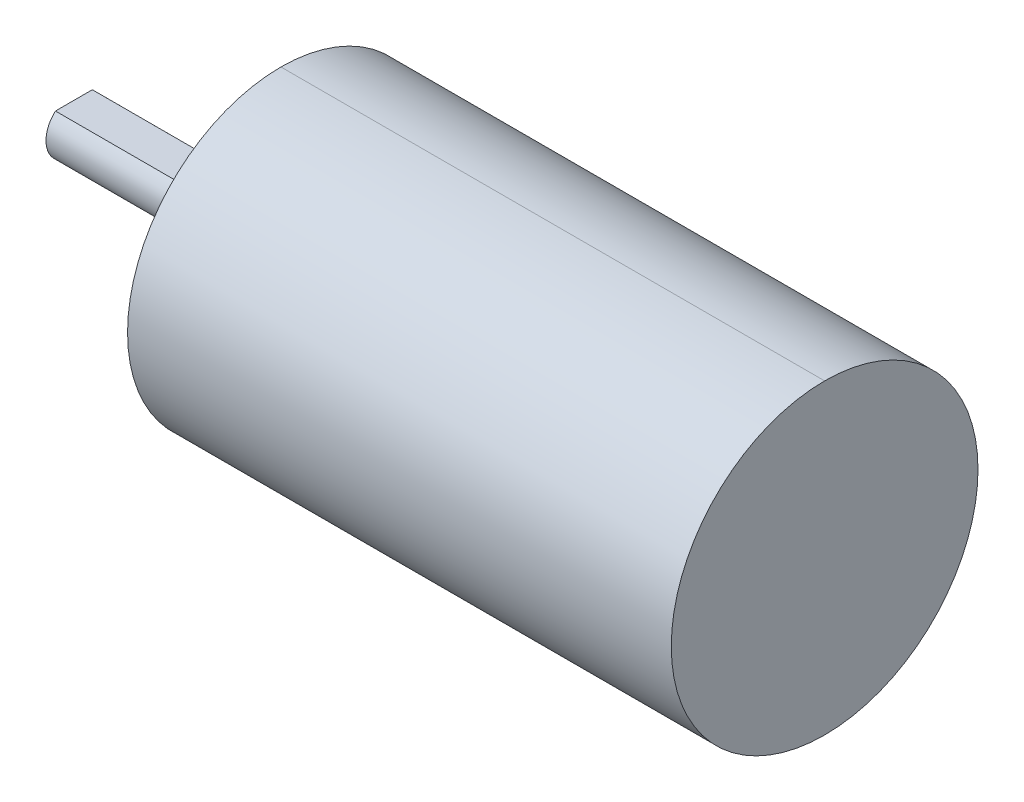
ISO-10303-21;
HEADER;
FILE_DESCRIPTION(('STEP AP214'),'2;1');
FILE_NAME('part.step','',(''),(''),'','','');
FILE_SCHEMA(('AUTOMOTIVE_DESIGN { 1 0 10303 214 1 1 1 1 }'));
ENDSEC;
DATA;
#1=APPLICATION_CONTEXT('core data for automotive mechanical design processes');
#2=APPLICATION_PROTOCOL_DEFINITION('international standard','automotive_design',2000,#1);
#3=PRODUCT_CONTEXT('',#1,'mechanical');
#4=PRODUCT('Part','Part','',(#3));
#5=PRODUCT_RELATED_PRODUCT_CATEGORY('part','',(#4));
#6=PRODUCT_DEFINITION_FORMATION('','',#4);
#7=PRODUCT_DEFINITION_CONTEXT('part definition',#1,'design');
#8=PRODUCT_DEFINITION('design','',#6,#7);
#9=PRODUCT_DEFINITION_SHAPE('','',#8);
#10=(LENGTH_UNIT() NAMED_UNIT(*) SI_UNIT(.MILLI.,.METRE.));
#11=(NAMED_UNIT(*) PLANE_ANGLE_UNIT() SI_UNIT($,.RADIAN.));
#12=(NAMED_UNIT(*) SI_UNIT($,.STERADIAN.) SOLID_ANGLE_UNIT());
#13=UNCERTAINTY_MEASURE_WITH_UNIT(LENGTH_MEASURE(1.E-05),#10,'distance_accuracy_value','');
#14=(GEOMETRIC_REPRESENTATION_CONTEXT(3) GLOBAL_UNCERTAINTY_ASSIGNED_CONTEXT((#13)) GLOBAL_UNIT_ASSIGNED_CONTEXT((#10,
#11,#12)) REPRESENTATION_CONTEXT('',''));
#15=CARTESIAN_POINT('',(0.,0.,0.));
#16=DIRECTION('',(0.,0.,1.));
#17=DIRECTION('',(1.,0.,0.));
#18=AXIS2_PLACEMENT_3D('',#15,#16,#17);
#19=CARTESIAN_POINT('',(21.15794106725,-3.5,6.062177826491));
#20=DIRECTION('',(-1.,0.,0.));
#21=DIRECTION('',(0.,-0.500000000000017,0.866025403784429));
#22=AXIS2_PLACEMENT_3D('',#19,#20,#21);
#23=CONICAL_SURFACE('',#22,0.5125,1.02974425867646);
#24=CARTESIAN_POINT('',(20.85,-3.5,6.062177826491));
#25=DIRECTION('',(-1.,0.,0.));
#26=DIRECTION('',(0.,-0.500000000000017,0.866025403784429));
#27=AXIS2_PLACEMENT_3D('',#24,#25,#26);
#28=CIRCLE('',#27,1.025);
#29=CARTESIAN_POINT('',(20.85,-4.0125,6.94985386537));
#30=VERTEX_POINT('',#29);
#31=CARTESIAN_POINT('',(20.85,-2.9875,5.174501787612));
#32=VERTEX_POINT('',#31);
#33=EDGE_CURVE('E247',#30,#32,#28,.T.);
#34=ORIENTED_EDGE('',*,*,#33,.T.);
#35=DIRECTION('',(-0.515038074910065,0.42858365035107,-0.742328657701349));
#36=VECTOR('',#35,1.);
#37=CARTESIAN_POINT('',(21.4658821345,-3.5,6.062177826491));
#38=LINE('',#37,#36);
#39=CARTESIAN_POINT('',(21.4658821345,-3.5,6.062177826491));
#40=VERTEX_POINT('',#39);
#41=EDGE_CURVE('E29',#40,#32,#38,.T.);
#42=ORIENTED_EDGE('',*,*,#41,.F.);
#43=DIRECTION('',(-0.515038074910065,-0.42858365035107,0.742328657701349));
#44=VECTOR('',#43,1.);
#45=CARTESIAN_POINT('',(21.4658821345,-3.5,6.062177826491));
#46=LINE('',#45,#44);
#47=EDGE_CURVE('E11',#40,#30,#46,.T.);
#48=ORIENTED_EDGE('',*,*,#47,.T.);
#49=EDGE_LOOP('',(#34,#42,#48));
#50=FACE_BOUND('',#49,.T.);
#51=ADVANCED_FACE('F17',(#50),#23,.F.);
#52=CARTESIAN_POINT('',(21.15794106725,-3.5,6.062177826491));
#53=DIRECTION('',(-1.,0.,0.));
#54=DIRECTION('',(0.,-0.500000000000017,0.866025403784429));
#55=AXIS2_PLACEMENT_3D('',#52,#53,#54);
#56=CONICAL_SURFACE('',#55,0.5125,1.02974425867646);
#57=ORIENTED_EDGE('',*,*,#41,.T.);
#58=CARTESIAN_POINT('',(20.85,-3.5,6.062177826491));
#59=DIRECTION('',(1.,0.,0.));
#60=DIRECTION('',(0.,-0.500000000000017,0.866025403784429));
#61=AXIS2_PLACEMENT_3D('',#58,#59,#60);
#62=CIRCLE('',#61,1.025);
#63=EDGE_CURVE('E218',#30,#32,#62,.T.);
#64=ORIENTED_EDGE('',*,*,#63,.F.);
#65=ORIENTED_EDGE('',*,*,#47,.F.);
#66=EDGE_LOOP('',(#57,#64,#65));
#67=FACE_BOUND('',#66,.T.);
#68=ADVANCED_FACE('F397',(#67),#56,.F.);
#69=CARTESIAN_POINT('',(21.79667624123,-3.5,6.062177826491));
#70=DIRECTION('',(-1.,0.,0.));
#71=DIRECTION('',(0.,-0.500000000000017,0.866025403784429));
#72=AXIS2_PLACEMENT_3D('',#69,#70,#71);
#73=CYLINDRICAL_SURFACE('',#72,1.025);
#74=DIRECTION('',(-1.,0.,0.));
#75=VECTOR('',#74,1.);
#76=CARTESIAN_POINT('',(20.85,-4.0125,6.94985386537));
#77=LINE('',#76,#75);
#78=CARTESIAN_POINT('',(14.85,-4.0125,6.94985386537));
#79=VERTEX_POINT('',#78);
#80=EDGE_CURVE('E244',#30,#79,#77,.T.);
#81=ORIENTED_EDGE('',*,*,#80,.F.);
#82=ORIENTED_EDGE('',*,*,#63,.T.);
#83=DIRECTION('',(-1.,0.,0.));
#84=VECTOR('',#83,1.);
#85=CARTESIAN_POINT('',(20.85,-2.9875,5.174501787612));
#86=LINE('',#85,#84);
#87=CARTESIAN_POINT('',(14.85,-2.9875,5.174501787612));
#88=VERTEX_POINT('',#87);
#89=EDGE_CURVE('E186',#32,#88,#86,.T.);
#90=ORIENTED_EDGE('',*,*,#89,.T.);
#91=CARTESIAN_POINT('',(14.85,-3.5,6.062177826491));
#92=DIRECTION('',(-1.,0.,0.));
#93=DIRECTION('',(0.,0.500000000000017,-0.866025403784429));
#94=AXIS2_PLACEMENT_3D('',#91,#92,#93);
#95=CIRCLE('',#94,1.025);
#96=EDGE_CURVE('E265',#88,#79,#95,.T.);
#97=ORIENTED_EDGE('',*,*,#96,.T.);
#98=EDGE_LOOP('',(#81,#82,#90,#97));
#99=FACE_BOUND('',#98,.T.);
#100=ADVANCED_FACE('F476',(#99),#73,.F.);
#101=CARTESIAN_POINT('',(21.79667624123,-3.5,6.062177826491));
#102=DIRECTION('',(-1.,0.,0.));
#103=DIRECTION('',(0.,-0.500000000000017,0.866025403784429));
#104=AXIS2_PLACEMENT_3D('',#101,#102,#103);
#105=CYLINDRICAL_SURFACE('',#104,1.025);
#106=ORIENTED_EDGE('',*,*,#89,.F.);
#107=ORIENTED_EDGE('',*,*,#33,.F.);
#108=ORIENTED_EDGE('',*,*,#80,.T.);
#109=CARTESIAN_POINT('',(14.85,-3.5,6.062177826491));
#110=DIRECTION('',(-1.,0.,0.));
#111=DIRECTION('',(0.,-0.500000000000017,0.866025403784429));
#112=AXIS2_PLACEMENT_3D('',#109,#110,#111);
#113=CIRCLE('',#112,1.025);
#114=EDGE_CURVE('E262',#79,#88,#113,.T.);
#115=ORIENTED_EDGE('',*,*,#114,.T.);
#116=EDGE_LOOP('',(#106,#107,#108,#115));
#117=FACE_BOUND('',#116,.T.);
#118=ADVANCED_FACE('F382',(#117),#105,.F.);
#119=CARTESIAN_POINT('',(21.15794106725,-3.5,-6.062177826491));
#120=DIRECTION('',(-1.,0.,0.));
#121=DIRECTION('',(0.,-0.500000000000017,-0.866025403784429));
#122=AXIS2_PLACEMENT_3D('',#119,#120,#121);
#123=CONICAL_SURFACE('',#122,0.5125,1.02974425867646);
#124=CARTESIAN_POINT('',(20.85,-3.5,-6.062177826491));
#125=DIRECTION('',(-1.,0.,0.));
#126=DIRECTION('',(0.,-0.500000000000017,-0.866025403784429));
#127=AXIS2_PLACEMENT_3D('',#124,#125,#126);
#128=CIRCLE('',#127,1.025);
#129=CARTESIAN_POINT('',(20.85,-4.0125,-6.94985386537));
#130=VERTEX_POINT('',#129);
#131=CARTESIAN_POINT('',(20.85,-2.9875,-5.174501787612));
#132=VERTEX_POINT('',#131);
#133=EDGE_CURVE('E190',#130,#132,#128,.T.);
#134=ORIENTED_EDGE('',*,*,#133,.T.);
#135=DIRECTION('',(-0.515038074910065,0.42858365035107,0.742328657701349));
#136=VECTOR('',#135,1.);
#137=CARTESIAN_POINT('',(21.4658821345,-3.5,-6.062177826491));
#138=LINE('',#137,#136);
#139=CARTESIAN_POINT('',(21.4658821345,-3.5,-6.062177826491));
#140=VERTEX_POINT('',#139);
#141=EDGE_CURVE('E179',#140,#132,#138,.T.);
#142=ORIENTED_EDGE('',*,*,#141,.F.);
#143=DIRECTION('',(-0.515038074910065,-0.42858365035107,-0.742328657701349));
#144=VECTOR('',#143,1.);
#145=CARTESIAN_POINT('',(21.4658821345,-3.5,-6.062177826491));
#146=LINE('',#145,#144);
#147=EDGE_CURVE('E176',#140,#130,#146,.T.);
#148=ORIENTED_EDGE('',*,*,#147,.T.);
#149=EDGE_LOOP('',(#134,#142,#148));
#150=FACE_BOUND('',#149,.T.);
#151=ADVANCED_FACE('F188',(#150),#123,.F.);
#152=CARTESIAN_POINT('',(21.15794106725,-3.5,-6.062177826491));
#153=DIRECTION('',(-1.,0.,0.));
#154=DIRECTION('',(0.,-0.500000000000017,-0.866025403784429));
#155=AXIS2_PLACEMENT_3D('',#152,#153,#154);
#156=CONICAL_SURFACE('',#155,0.5125,1.02974425867646);
#157=ORIENTED_EDGE('',*,*,#141,.T.);
#158=CARTESIAN_POINT('',(20.85,-3.5,-6.062177826491));
#159=DIRECTION('',(1.,0.,0.));
#160=DIRECTION('',(0.,-0.500000000000017,-0.866025403784429));
#161=AXIS2_PLACEMENT_3D('',#158,#159,#160);
#162=CIRCLE('',#161,1.025);
#163=EDGE_CURVE('E181',#130,#132,#162,.T.);
#164=ORIENTED_EDGE('',*,*,#163,.F.);
#165=ORIENTED_EDGE('',*,*,#147,.F.);
#166=EDGE_LOOP('',(#157,#164,#165));
#167=FACE_BOUND('',#166,.T.);
#168=ADVANCED_FACE('F178',(#167),#156,.F.);
#169=CARTESIAN_POINT('',(21.79667624123,-3.5,-6.062177826491));
#170=DIRECTION('',(-1.,0.,0.));
#171=DIRECTION('',(0.,-0.500000000000017,-0.866025403784429));
#172=AXIS2_PLACEMENT_3D('',#169,#170,#171);
#173=CYLINDRICAL_SURFACE('',#172,1.025);
#174=DIRECTION('',(-1.,0.,0.));
#175=VECTOR('',#174,1.);
#176=CARTESIAN_POINT('',(20.85,-4.0125,-6.94985386537));
#177=LINE('',#176,#175);
#178=CARTESIAN_POINT('',(14.85,-4.0125,-6.94985386537));
#179=VERTEX_POINT('',#178);
#180=EDGE_CURVE('E199',#130,#179,#177,.T.);
#181=ORIENTED_EDGE('',*,*,#180,.F.);
#182=ORIENTED_EDGE('',*,*,#163,.T.);
#183=DIRECTION('',(-1.,0.,0.));
#184=VECTOR('',#183,1.);
#185=CARTESIAN_POINT('',(20.85,-2.9875,-5.174501787612));
#186=LINE('',#185,#184);
#187=CARTESIAN_POINT('',(14.85,-2.9875,-5.174501787612));
#188=VERTEX_POINT('',#187);
#189=EDGE_CURVE('E225',#132,#188,#186,.T.);
#190=ORIENTED_EDGE('',*,*,#189,.T.);
#191=CARTESIAN_POINT('',(14.85,-3.5,-6.062177826491));
#192=DIRECTION('',(-1.,0.,0.));
#193=DIRECTION('',(0.,0.500000000000017,0.866025403784429));
#194=AXIS2_PLACEMENT_3D('',#191,#192,#193);
#195=CIRCLE('',#194,1.025);
#196=EDGE_CURVE('E309',#188,#179,#195,.T.);
#197=ORIENTED_EDGE('',*,*,#196,.T.);
#198=EDGE_LOOP('',(#181,#182,#190,#197));
#199=FACE_BOUND('',#198,.T.);
#200=ADVANCED_FACE('F406',(#199),#173,.F.);
#201=CARTESIAN_POINT('',(21.79667624123,-3.5,-6.062177826491));
#202=DIRECTION('',(-1.,0.,0.));
#203=DIRECTION('',(0.,-0.500000000000017,-0.866025403784429));
#204=AXIS2_PLACEMENT_3D('',#201,#202,#203);
#205=CYLINDRICAL_SURFACE('',#204,1.025);
#206=ORIENTED_EDGE('',*,*,#189,.F.);
#207=ORIENTED_EDGE('',*,*,#133,.F.);
#208=ORIENTED_EDGE('',*,*,#180,.T.);
#209=CARTESIAN_POINT('',(14.85,-3.5,-6.062177826491));
#210=DIRECTION('',(-1.,0.,0.));
#211=DIRECTION('',(0.,-0.500000000000017,-0.866025403784429));
#212=AXIS2_PLACEMENT_3D('',#209,#210,#211);
#213=CIRCLE('',#212,1.025);
#214=EDGE_CURVE('E313',#179,#188,#213,.T.);
#215=ORIENTED_EDGE('',*,*,#214,.T.);
#216=EDGE_LOOP('',(#206,#207,#208,#215));
#217=FACE_BOUND('',#216,.T.);
#218=ADVANCED_FACE('F408',(#217),#205,.F.);
#219=CARTESIAN_POINT('',(21.15794106725,7.,0.));
#220=DIRECTION('',(-1.,0.,0.));
#221=DIRECTION('',(0.,1.,0.));
#222=AXIS2_PLACEMENT_3D('',#219,#220,#221);
#223=CONICAL_SURFACE('',#222,0.5125,1.02974425867646);
#224=CARTESIAN_POINT('',(20.85,7.,0.));
#225=DIRECTION('',(-1.,0.,0.));
#226=DIRECTION('',(0.,1.,0.));
#227=AXIS2_PLACEMENT_3D('',#224,#225,#226);
#228=CIRCLE('',#227,1.025);
#229=CARTESIAN_POINT('',(20.85,8.025,0.));
#230=VERTEX_POINT('',#229);
#231=CARTESIAN_POINT('',(20.85,5.975,0.));
#232=VERTEX_POINT('',#231);
#233=EDGE_CURVE('E274',#230,#232,#228,.T.);
#234=ORIENTED_EDGE('',*,*,#233,.T.);
#235=DIRECTION('',(-0.515038074910093,-0.857167300702089,0.));
#236=VECTOR('',#235,1.);
#237=CARTESIAN_POINT('',(21.4658821345,7.,0.));
#238=LINE('',#237,#236);
#239=CARTESIAN_POINT('',(21.4658821345,7.,0.));
#240=VERTEX_POINT('',#239);
#241=EDGE_CURVE('E306',#240,#232,#238,.T.);
#242=ORIENTED_EDGE('',*,*,#241,.F.);
#243=DIRECTION('',(-0.515038074910093,0.857167300702089,0.));
#244=VECTOR('',#243,1.);
#245=CARTESIAN_POINT('',(21.4658821345,7.,0.));
#246=LINE('',#245,#244);
#247=EDGE_CURVE('E228',#240,#230,#246,.T.);
#248=ORIENTED_EDGE('',*,*,#247,.T.);
#249=EDGE_LOOP('',(#234,#242,#248));
#250=FACE_BOUND('',#249,.T.);
#251=ADVANCED_FACE('F404',(#250),#223,.F.);
#252=CARTESIAN_POINT('',(21.15794106725,7.,0.));
#253=DIRECTION('',(-1.,0.,0.));
#254=DIRECTION('',(0.,1.,0.));
#255=AXIS2_PLACEMENT_3D('',#252,#253,#254);
#256=CONICAL_SURFACE('',#255,0.5125,1.02974425867646);
#257=ORIENTED_EDGE('',*,*,#241,.T.);
#258=CARTESIAN_POINT('',(20.85,7.,0.));
#259=DIRECTION('',(1.,0.,0.));
#260=DIRECTION('',(0.,1.,0.));
#261=AXIS2_PLACEMENT_3D('',#258,#259,#260);
#262=CIRCLE('',#261,1.025);
#263=EDGE_CURVE('E302',#230,#232,#262,.T.);
#264=ORIENTED_EDGE('',*,*,#263,.F.);
#265=ORIENTED_EDGE('',*,*,#247,.F.);
#266=EDGE_LOOP('',(#257,#264,#265));
#267=FACE_BOUND('',#266,.T.);
#268=ADVANCED_FACE('F401',(#267),#256,.F.);
#269=CARTESIAN_POINT('',(21.79667624123,7.,0.));
#270=DIRECTION('',(-1.,0.,0.));
#271=DIRECTION('',(0.,1.,0.));
#272=AXIS2_PLACEMENT_3D('',#269,#270,#271);
#273=CYLINDRICAL_SURFACE('',#272,1.025);
#274=DIRECTION('',(-1.,0.,0.));
#275=VECTOR('',#274,1.);
#276=CARTESIAN_POINT('',(20.85,8.025,0.));
#277=LINE('',#276,#275);
#278=CARTESIAN_POINT('',(14.85,8.025,0.));
#279=VERTEX_POINT('',#278);
#280=EDGE_CURVE('E278',#230,#279,#277,.T.);
#281=ORIENTED_EDGE('',*,*,#280,.F.);
#282=ORIENTED_EDGE('',*,*,#263,.T.);
#283=DIRECTION('',(-1.,0.,0.));
#284=VECTOR('',#283,1.);
#285=CARTESIAN_POINT('',(20.85,5.975,0.));
#286=LINE('',#285,#284);
#287=CARTESIAN_POINT('',(14.85,5.975,0.));
#288=VERTEX_POINT('',#287);
#289=EDGE_CURVE('E279',#232,#288,#286,.T.);
#290=ORIENTED_EDGE('',*,*,#289,.T.);
#291=CARTESIAN_POINT('',(14.85,7.,0.));
#292=DIRECTION('',(-1.,0.,0.));
#293=DIRECTION('',(0.,-1.,0.));
#294=AXIS2_PLACEMENT_3D('',#291,#292,#293);
#295=CIRCLE('',#294,1.025);
#296=EDGE_CURVE('E289',#288,#279,#295,.T.);
#297=ORIENTED_EDGE('',*,*,#296,.T.);
#298=EDGE_LOOP('',(#281,#282,#290,#297));
#299=FACE_BOUND('',#298,.T.);
#300=ADVANCED_FACE('F403',(#299),#273,.F.);
#301=CARTESIAN_POINT('',(21.79667624123,7.,0.));
#302=DIRECTION('',(-1.,0.,0.));
#303=DIRECTION('',(0.,1.,0.));
#304=AXIS2_PLACEMENT_3D('',#301,#302,#303);
#305=CYLINDRICAL_SURFACE('',#304,1.025);
#306=ORIENTED_EDGE('',*,*,#289,.F.);
#307=ORIENTED_EDGE('',*,*,#233,.F.);
#308=ORIENTED_EDGE('',*,*,#280,.T.);
#309=CARTESIAN_POINT('',(14.85,7.,0.));
#310=DIRECTION('',(-1.,0.,0.));
#311=DIRECTION('',(0.,1.,0.));
#312=AXIS2_PLACEMENT_3D('',#309,#310,#311);
#313=CIRCLE('',#312,1.025);
#314=EDGE_CURVE('E297',#279,#288,#313,.T.);
#315=ORIENTED_EDGE('',*,*,#314,.T.);
#316=EDGE_LOOP('',(#306,#307,#308,#315));
#317=FACE_BOUND('',#316,.T.);
#318=ADVANCED_FACE('F456',(#317),#305,.F.);
#319=CARTESIAN_POINT('',(0.,0.,0.));
#320=DIRECTION('',(1.,0.,0.));
#321=DIRECTION('',(0.,1.,0.));
#322=AXIS2_PLACEMENT_3D('',#319,#320,#321);
#323=PLANE('',#322);
#324=CARTESIAN_POINT('',(0.,0.,0.));
#325=DIRECTION('',(-1.,0.,0.));
#326=DIRECTION('',(0.,0.750000000000024,-0.661437827766121));
#327=AXIS2_PLACEMENT_3D('',#324,#325,#326);
#328=CIRCLE('',#327,2.);
#329=CARTESIAN_POINT('',(0.,1.5,-1.322875655532));
#330=VERTEX_POINT('',#329);
#331=CARTESIAN_POINT('',(0.,-2.,0.));
#332=VERTEX_POINT('',#331);
#333=EDGE_CURVE('E233',#330,#332,#328,.T.);
#334=ORIENTED_EDGE('',*,*,#333,.T.);
#335=CARTESIAN_POINT('',(0.,0.,0.));
#336=DIRECTION('',(1.,0.,0.));
#337=DIRECTION('',(0.,0.750000000000024,0.661437827766121));
#338=AXIS2_PLACEMENT_3D('',#335,#336,#337);
#339=CIRCLE('',#338,2.);
#340=CARTESIAN_POINT('',(0.,1.5,1.322875655532));
#341=VERTEX_POINT('',#340);
#342=EDGE_CURVE('E155',#341,#332,#339,.T.);
#343=ORIENTED_EDGE('',*,*,#342,.F.);
#344=DIRECTION('',(0.,0.,-1.));
#345=VECTOR('',#344,1.);
#346=CARTESIAN_POINT('',(0.,1.5,1.322875655532));
#347=LINE('',#346,#345);
#348=EDGE_CURVE('E140',#341,#330,#347,.T.);
#349=ORIENTED_EDGE('',*,*,#348,.T.);
#350=EDGE_LOOP('',(#334,#343,#349));
#351=FACE_BOUND('',#350,.T.);
#352=ADVANCED_FACE('F467',(#351),#323,.F.);
#353=CARTESIAN_POINT('',(9.3,1.5,-7.4623));
#354=DIRECTION('',(0.707106781186548,-0.707106781186548,0.));
#355=DIRECTION('',(0.,0.,-1.));
#356=AXIS2_PLACEMENT_3D('',#353,#354,#355);
#357=PLANE('',#356);
#358=CARTESIAN_POINT('',(9.3,1.50000000000015,-1.32287565553213));
#359=CARTESIAN_POINT('',(9.31935668880468,1.51935717272511,-1.30092639373505));
#360=CARTESIAN_POINT('',(9.33837674786416,1.5383827432485,-1.27838250588553));
#361=CARTESIAN_POINT('',(9.37521489337779,1.57523531237786,-1.23266968913611));
#362=CARTESIAN_POINT('',(9.39305103739206,1.59308028156257,-1.20952977377903));
#363=CARTESIAN_POINT('',(9.42752231750336,1.62756642474667,-1.16269182678271));
#364=CARTESIAN_POINT('',(9.44417619721517,1.64422640553281,-1.1390214890943));
#365=CARTESIAN_POINT('',(9.47628148148035,1.67633926260486,-1.09119019404082));
#366=CARTESIAN_POINT('',(9.49175234587905,1.6918117084446,-1.0670554466042));
#367=CARTESIAN_POINT('',(9.5243859638678,1.72444531892202,-1.01362026631911));
#368=CARTESIAN_POINT('',(9.54139659432951,1.74145378347605,-0.984132934752813));
#369=CARTESIAN_POINT('',(9.57367952952433,1.77373587659159,-0.924647470114502));
#370=CARTESIAN_POINT('',(9.58898773814278,1.78904531055467,-0.894688359074436));
#371=CARTESIAN_POINT('',(9.61445632789835,1.81453440564306,-0.841483105678523));
#372=CARTESIAN_POINT('',(9.62491842578194,1.82501099400102,-0.818522756643126));
#373=CARTESIAN_POINT('',(9.64492224632441,1.84504978601381,-0.772280190456877));
#374=CARTESIAN_POINT('',(9.65447531685562,1.85462324551859,-0.749007795638735));
#375=CARTESIAN_POINT('',(9.66928949367996,1.86947039623234,-0.7108620513117));
#376=CARTESIAN_POINT('',(9.67479552347575,1.87498901534226,-0.696178091157283));
#377=CARTESIAN_POINT('',(9.6854498786575,1.88566736938612,-0.666709862633034));
#378=CARTESIAN_POINT('',(9.69060085799845,1.89082976743473,-0.651927522782879));
#379=CARTESIAN_POINT('',(9.70054502290386,1.90079466460827,-0.622271905435026));
#380=CARTESIAN_POINT('',(9.70534080143313,1.9055997732304,-0.607400374194626));
#381=CARTESIAN_POINT('',(9.71457466860114,1.914849514098,-0.57757526195792));
#382=CARTESIAN_POINT('',(9.71901527749626,1.91929668797288,-0.562623250336827));
#383=CARTESIAN_POINT('',(9.72753887111456,1.92783015627708,-0.532646149440359));
#384=CARTESIAN_POINT('',(9.73162429334849,1.9319189123179,-0.517622454529229));
#385=CARTESIAN_POINT('',(9.7394376027043,1.93973538288215,-0.487510885332949));
#386=CARTESIAN_POINT('',(9.74316783391241,1.94346546635249,-0.47242423477944));
#387=CARTESIAN_POINT('',(9.75027085751999,1.95056464985063,-0.442195612561176));
#388=CARTESIAN_POINT('',(9.75364588996572,1.95393601382645,-0.42705469941775));
#389=CARTESIAN_POINT('',(9.7600386239262,1.96031803857699,-0.396726353369745));
#390=CARTESIAN_POINT('',(9.7630584508447,1.96333084623516,-0.381539820655814));
#391=CARTESIAN_POINT('',(9.76874089195965,1.9689962563866,-0.351128976523368));
#392=CARTESIAN_POINT('',(9.77140550647891,1.97165087708223,-0.335905415218068));
#393=CARTESIAN_POINT('',(9.77637765153875,1.97660062630517,-0.305429187866859));
#394=CARTESIAN_POINT('',(9.77868704715513,1.97889763331528,-0.29017713149871));
#395=CARTESIAN_POINT('',(9.78294889293839,1.98313307905259,-0.259652515012971));
#396=CARTESIAN_POINT('',(9.78490306316853,1.98507324623068,-0.244380435131495));
#397=CARTESIAN_POINT('',(9.78845460738419,1.98859614500074,-0.213824294220603));
#398=CARTESIAN_POINT('',(9.79005354717227,1.99018044555539,-0.198540596274084));
#399=CARTESIAN_POINT('',(9.79289478496186,1.99299294241961,-0.1679696561871));
#400=CARTESIAN_POINT('',(9.79413848592687,1.99422253977432,-0.152682673487356));
#401=CARTESIAN_POINT('',(9.79626942307862,1.9963271788884,-0.122113515858261));
#402=CARTESIAN_POINT('',(9.79715789151338,1.99720344638719,-0.106831511325125));
#403=CARTESIAN_POINT('',(9.79857849559434,1.99860310244176,-0.076280549212547));
#404=CARTESIAN_POINT('',(9.79911168600362,1.99912753556898,-0.0610116886372564));
#405=CARTESIAN_POINT('',(9.79982206802219,1.99982563822957,-0.0304952198216322));
#406=CARTESIAN_POINT('',(9.80000013044125,2.00000016577235,-0.0152476514396513));
#407=CARTESIAN_POINT('',(9.8,2.,0.));
#408=B_SPLINE_CURVE_WITH_KNOTS('',3,(#358,#359,#360,#361,#362,#363,#364,#365,#366,#367,#368,
#369,#370,#371,#372,#373,#374,#375,#376,#377,#378,#379,#380,#381,#382,#383,#384,#385,#386,#387,
#388,#389,#390,#391,#392,#393,#394,#395,#396,#397,#398,#399,#400,#401,#402,#403,#404,#405,#406,
#407),.UNSPECIFIED.,.F.,.F.,(4,2,2,2,2,2,2,2,2,2,2,2,2,2,2,2,2,2,2,2,2,2,2,2,4),(0.,
0.105259848836809,0.207930616545605,0.308078047904573,0.405772982265283,0.519872605819555,
0.630693760129947,0.712627465803893,0.793346144929548,0.843214604114973,0.892657049926071,
0.941693089079913,0.990342819663824,1.03862682216743,1.08656614810716,1.13418230615531,
1.18149724570844,1.22853333785607,1.27531335373994,1.32186044032605,1.36819809364617,
1.41435012960121,1.46034065245544,1.50619402118737,1.55193481389792),.UNSPECIFIED.);
#409=CARTESIAN_POINT('',(9.3,1.5,-1.322875655532));
#410=VERTEX_POINT('',#409);
#411=CARTESIAN_POINT('',(9.8,2.,0.));
#412=VERTEX_POINT('',#411);
#413=EDGE_CURVE('E358',#410,#412,#408,.T.);
#414=ORIENTED_EDGE('',*,*,#413,.F.);
#415=DIRECTION('',(0.,0.,1.));
#416=VECTOR('',#415,1.);
#417=CARTESIAN_POINT('',(9.3,1.5,-1.322875655532));
#418=LINE('',#417,#416);
#419=CARTESIAN_POINT('',(9.3,1.5,1.322875655532));
#420=VERTEX_POINT('',#419);
#421=EDGE_CURVE('E340',#410,#420,#418,.T.);
#422=ORIENTED_EDGE('',*,*,#421,.T.);
#423=CARTESIAN_POINT('',(9.8,2.,0.));
#424=CARTESIAN_POINT('',(9.80000013300265,2.00000016876567,0.0153292068199842));
#425=CARTESIAN_POINT('',(9.79982067077837,1.99982376804863,0.030658333296037));
#426=CARTESIAN_POINT('',(9.7991046040086,1.9991182295232,0.0613356908330347));
#427=CARTESIAN_POINT('',(9.79856717291242,1.99858827535479,0.0766838838628157));
#428=CARTESIAN_POINT('',(9.79713520239808,1.99717402735451,0.107391161826835));
#429=CARTESIAN_POINT('',(9.79623964926001,1.99628872763519,0.122750153066661));
#430=CARTESIAN_POINT('',(9.79409166175336,1.99416262250421,0.153470817857794));
#431=CARTESIAN_POINT('',(9.79283803277843,1.99292062701308,0.16883232541749));
#432=CARTESIAN_POINT('',(9.7899740612664,1.99008008330219,0.199549738817321));
#433=CARTESIAN_POINT('',(9.78836234988007,1.98848016668282,0.214905390341498));
#434=CARTESIAN_POINT('',(9.78478238839925,1.98492294017174,0.24560275836689));
#435=CARTESIAN_POINT('',(9.78281260299654,1.98296409098969,0.26094411725163));
#436=CARTESIAN_POINT('',(9.77851665644025,1.97868834389093,0.29160451490926));
#437=CARTESIAN_POINT('',(9.77618880204499,1.97636974430247,0.306923078885261));
#438=CARTESIAN_POINT('',(9.7711768726949,1.97137403395482,0.337529454750519));
#439=CARTESIAN_POINT('',(9.76849095579784,1.96869506871359,0.35281666201935));
#440=CARTESIAN_POINT('',(9.7627630469026,1.96297835773282,0.383351848520921));
#441=CARTESIAN_POINT('',(9.75971907404832,1.95993861516077,0.39859908198142));
#442=CARTESIAN_POINT('',(9.75327518880832,1.95350027557887,0.429045804367029));
#443=CARTESIAN_POINT('',(9.74987316687347,1.9500995506007,0.444244396417996));
#444=CARTESIAN_POINT('',(9.74271330865006,1.94293936932062,0.474585282463906));
#445=CARTESIAN_POINT('',(9.73895324464571,1.93917766573433,0.48972651994742));
#446=CARTESIAN_POINT('',(9.73107741689935,1.9312958495924,0.519944109204198));
#447=CARTESIAN_POINT('',(9.72695931798616,1.92717338271937,0.535019237715403));
#448=CARTESIAN_POINT('',(9.71836752407025,1.91857056256238,0.56509599305157));
#449=CARTESIAN_POINT('',(9.71389139721895,1.91408776052448,0.580096224182965));
#450=CARTESIAN_POINT('',(9.70458364104495,1.90476499840077,0.610014535675816));
#451=CARTESIAN_POINT('',(9.69974949394264,1.89992250793458,0.62493104355312));
#452=CARTESIAN_POINT('',(9.68972577728305,1.88988129138563,0.654673262137498));
#453=CARTESIAN_POINT('',(9.68453361459517,1.88467996605626,0.669497220806026));
#454=CARTESIAN_POINT('',(9.67379394712205,1.8739222500864,0.699045580429958));
#455=CARTESIAN_POINT('',(9.66824378432542,1.86836320446985,0.713768047297623));
#456=CARTESIAN_POINT('',(9.65596209574157,1.85606404756147,0.745220455767468));
#457=CARTESIAN_POINT('',(9.64918011992448,1.84927374184061,0.761911098604649));
#458=CARTESIAN_POINT('',(9.63515236950346,1.83523393064921,0.795138434023685));
#459=CARTESIAN_POINT('',(9.62790246585916,1.82798034544863,0.811671659194814));
#460=CARTESIAN_POINT('',(9.61549245692193,1.81556896622257,0.83895974367606));
#461=CARTESIAN_POINT('',(9.61043789023493,1.81051512667113,0.849810207404745));
#462=CARTESIAN_POINT('',(9.60011426446099,1.8001937724671,0.871462943485966));
#463=CARTESIAN_POINT('',(9.59484356984972,1.79492463036258,0.882263658072188));
#464=CARTESIAN_POINT('',(9.57679577092989,1.7768827308703,0.918420244787606));
#465=CARTESIAN_POINT('',(9.56364512980538,1.76373734739095,0.943406492380975));
#466=CARTESIAN_POINT('',(9.53618699809318,1.73628602766596,0.993043050743088));
#467=CARTESIAN_POINT('',(9.52185931067538,1.72195980262822,1.01767088587116));
#468=CARTESIAN_POINT('',(9.49204569365482,1.69214286024891,1.06653243402895));
#469=CARTESIAN_POINT('',(9.47654007342879,1.67663229946468,1.09074200777642));
#470=CARTESIAN_POINT('',(9.44437019556124,1.64444676135128,1.13870509003268));
#471=CARTESIAN_POINT('',(9.42768685134103,1.62775255872014,1.16243286342783));
#472=CARTESIAN_POINT('',(9.39316122215414,1.59320302875955,1.20936932275826));
#473=CARTESIAN_POINT('',(9.37530050920412,1.57532922622353,1.23255080935894));
#474=CARTESIAN_POINT('',(9.33841798764607,1.53842594502891,1.27833135395514));
#475=CARTESIAN_POINT('',(9.31937839831858,1.51937882746218,1.30090189370666));
#476=CARTESIAN_POINT('',(9.3,1.50000000000014,1.32287565553213));
#477=B_SPLINE_CURVE_WITH_KNOTS('',3,(#423,#424,#425,#426,#427,#428,#429,#430,#431,#432,#433,
#434,#435,#436,#437,#438,#439,#440,#441,#442,#443,#444,#445,#446,#447,#448,#449,#450,#451,#452,
#453,#454,#455,#456,#457,#458,#459,#460,#461,#462,#463,#464,#465,#466,#467,#468,#469,#470,#471,
#472,#473,#474,#475,#476),.UNSPECIFIED.,.F.,.F.,(4,2,2,2,2,2,2,2,2,2,2,2,2,2,2,2,2,2,2,2,2,2,2,
2,2,2,4),(0.,0.0459854357198155,0.0920774216778938,0.138300812299153,0.184680250752268,
0.231240132427904,0.278004570324477,0.324997362554909,0.372241962152403,0.419761449316245,
0.467578506201432,0.515715394319118,0.564193934579548,0.613035489975862,0.66226095087659,
0.711890722867226,0.761944717057299,0.819692976820661,0.878048827606092,0.917025432754209,
0.956390450813744,1.04978568966306,1.14542369620945,1.24338688575449,1.34375194565219,
1.44659019001107,1.55196791179629),.UNSPECIFIED.);
#478=EDGE_CURVE('E300',#412,#420,#477,.T.);
#479=ORIENTED_EDGE('',*,*,#478,.F.);
#480=EDGE_LOOP('',(#414,#422,#479));
#481=FACE_BOUND('',#480,.T.);
#482=ADVANCED_FACE('F381',(#481),#357,.F.);
#483=CARTESIAN_POINT('',(-2.5475,0.,0.));
#484=DIRECTION('',(1.,0.,0.));
#485=DIRECTION('',(0.,-1.,0.));
#486=AXIS2_PLACEMENT_3D('',#483,#484,#485);
#487=CYLINDRICAL_SURFACE('',#486,2.);
#488=ORIENTED_EDGE('',*,*,#342,.T.);
#489=DIRECTION('',(-1.,0.,0.));
#490=VECTOR('',#489,1.);
#491=CARTESIAN_POINT('',(11.7,-2.,0.));
#492=LINE('',#491,#490);
#493=CARTESIAN_POINT('',(11.7,-2.,0.));
#494=VERTEX_POINT('',#493);
#495=EDGE_CURVE('E229',#494,#332,#492,.T.);
#496=ORIENTED_EDGE('',*,*,#495,.F.);
#497=CARTESIAN_POINT('',(11.7,0.,0.));
#498=DIRECTION('',(1.,0.,0.));
#499=DIRECTION('',(0.,1.,0.));
#500=AXIS2_PLACEMENT_3D('',#497,#498,#499);
#501=CIRCLE('',#500,2.);
#502=CARTESIAN_POINT('',(11.7,2.,0.));
#503=VERTEX_POINT('',#502);
#504=EDGE_CURVE('E219',#503,#494,#501,.T.);
#505=ORIENTED_EDGE('',*,*,#504,.F.);
#506=DIRECTION('',(-1.,0.,0.));
#507=VECTOR('',#506,1.);
#508=CARTESIAN_POINT('',(11.7,2.,0.));
#509=LINE('',#508,#507);
#510=EDGE_CURVE('E234',#503,#412,#509,.T.);
#511=ORIENTED_EDGE('',*,*,#510,.T.);
#512=ORIENTED_EDGE('',*,*,#478,.T.);
#513=DIRECTION('',(1.,0.,0.));
#514=VECTOR('',#513,1.);
#515=CARTESIAN_POINT('',(0.,1.5,1.322875655532));
#516=LINE('',#515,#514);
#517=EDGE_CURVE('E301',#341,#420,#516,.T.);
#518=ORIENTED_EDGE('',*,*,#517,.F.);
#519=EDGE_LOOP('',(#488,#496,#505,#511,#512,#518));
#520=FACE_BOUND('',#519,.T.);
#521=ADVANCED_FACE('F370',(#520),#487,.T.);
#522=CARTESIAN_POINT('',(0.,1.5,-7.4623));
#523=DIRECTION('',(0.,-1.,0.));
#524=DIRECTION('',(0.,0.,-1.));
#525=AXIS2_PLACEMENT_3D('',#522,#523,#524);
#526=PLANE('',#525);
#527=ORIENTED_EDGE('',*,*,#421,.F.);
#528=DIRECTION('',(1.,0.,0.));
#529=VECTOR('',#528,1.);
#530=CARTESIAN_POINT('',(0.,1.5,-1.322875655532));
#531=LINE('',#530,#529);
#532=EDGE_CURVE('E273',#330,#410,#531,.T.);
#533=ORIENTED_EDGE('',*,*,#532,.F.);
#534=ORIENTED_EDGE('',*,*,#348,.F.);
#535=ORIENTED_EDGE('',*,*,#517,.T.);
#536=EDGE_LOOP('',(#527,#533,#534,#535));
#537=FACE_BOUND('',#536,.T.);
#538=ADVANCED_FACE('F380',(#537),#526,.F.);
#539=CARTESIAN_POINT('',(-2.5475,0.,0.));
#540=DIRECTION('',(1.,0.,0.));
#541=DIRECTION('',(0.,-1.,0.));
#542=AXIS2_PLACEMENT_3D('',#539,#540,#541);
#543=CYLINDRICAL_SURFACE('',#542,2.);
#544=ORIENTED_EDGE('',*,*,#413,.T.);
#545=ORIENTED_EDGE('',*,*,#510,.F.);
#546=CARTESIAN_POINT('',(11.7,0.,0.));
#547=DIRECTION('',(-1.,0.,0.));
#548=DIRECTION('',(0.,1.,0.));
#549=AXIS2_PLACEMENT_3D('',#546,#547,#548);
#550=CIRCLE('',#549,2.);
#551=EDGE_CURVE('E223',#503,#494,#550,.T.);
#552=ORIENTED_EDGE('',*,*,#551,.T.);
#553=ORIENTED_EDGE('',*,*,#495,.T.);
#554=ORIENTED_EDGE('',*,*,#333,.F.);
#555=ORIENTED_EDGE('',*,*,#532,.T.);
#556=EDGE_LOOP('',(#544,#545,#552,#553,#554,#555));
#557=FACE_BOUND('',#556,.T.);
#558=ADVANCED_FACE('F19',(#557),#543,.T.);
#559=CARTESIAN_POINT('',(11.7,0.,0.));
#560=DIRECTION('',(1.,0.,0.));
#561=DIRECTION('',(0.,1.,0.));
#562=AXIS2_PLACEMENT_3D('',#559,#560,#561);
#563=PLANE('',#562);
#564=ORIENTED_EDGE('',*,*,#504,.T.);
#565=ORIENTED_EDGE('',*,*,#551,.F.);
#566=EDGE_LOOP('',(#564,#565));
#567=FACE_BOUND('',#566,.T.);
#568=CARTESIAN_POINT('',(11.7,0.,0.));
#569=DIRECTION('',(-1.,0.,0.));
#570=DIRECTION('',(0.,1.,0.));
#571=AXIS2_PLACEMENT_3D('',#568,#569,#570);
#572=CIRCLE('',#571,3.5);
#573=CARTESIAN_POINT('',(11.7,3.5,0.));
#574=VERTEX_POINT('',#573);
#575=CARTESIAN_POINT('',(11.7,-3.5,0.));
#576=VERTEX_POINT('',#575);
#577=EDGE_CURVE('E208',#574,#576,#572,.T.);
#578=ORIENTED_EDGE('',*,*,#577,.T.);
#579=CARTESIAN_POINT('',(11.7,0.,0.));
#580=DIRECTION('',(1.,0.,0.));
#581=DIRECTION('',(0.,1.,0.));
#582=AXIS2_PLACEMENT_3D('',#579,#580,#581);
#583=CIRCLE('',#582,3.5);
#584=EDGE_CURVE('E224',#574,#576,#583,.T.);
#585=ORIENTED_EDGE('',*,*,#584,.F.);
#586=EDGE_LOOP('',(#578,#585));
#587=FACE_BOUND('',#586,.T.);
#588=ADVANCED_FACE('F384',(#567,#587),#563,.F.);
#589=CARTESIAN_POINT('',(-2.5475,0.,0.));
#590=DIRECTION('',(1.,0.,0.));
#591=DIRECTION('',(0.,-1.,0.));
#592=AXIS2_PLACEMENT_3D('',#589,#590,#591);
#593=CYLINDRICAL_SURFACE('',#592,3.5);
#594=ORIENTED_EDGE('',*,*,#584,.T.);
#595=DIRECTION('',(-1.,0.,0.));
#596=VECTOR('',#595,1.);
#597=CARTESIAN_POINT('',(13.5,-3.5,0.));
#598=LINE('',#597,#596);
#599=CARTESIAN_POINT('',(13.5,-3.5,0.));
#600=VERTEX_POINT('',#599);
#601=EDGE_CURVE('E204',#600,#576,#598,.T.);
#602=ORIENTED_EDGE('',*,*,#601,.F.);
#603=CARTESIAN_POINT('',(13.5,0.,0.));
#604=DIRECTION('',(1.,0.,0.));
#605=DIRECTION('',(0.,1.,0.));
#606=AXIS2_PLACEMENT_3D('',#603,#604,#605);
#607=CIRCLE('',#606,3.5);
#608=CARTESIAN_POINT('',(13.5,3.5,0.));
#609=VERTEX_POINT('',#608);
#610=EDGE_CURVE('E270',#609,#600,#607,.T.);
#611=ORIENTED_EDGE('',*,*,#610,.F.);
#612=DIRECTION('',(-1.,0.,0.));
#613=VECTOR('',#612,1.);
#614=CARTESIAN_POINT('',(13.5,3.5,0.));
#615=LINE('',#614,#613);
#616=EDGE_CURVE('E251',#609,#574,#615,.T.);
#617=ORIENTED_EDGE('',*,*,#616,.T.);
#618=EDGE_LOOP('',(#594,#602,#611,#617));
#619=FACE_BOUND('',#618,.T.);
#620=ADVANCED_FACE('F387',(#619),#593,.T.);
#621=CARTESIAN_POINT('',(-2.5475,0.,0.));
#622=DIRECTION('',(1.,0.,0.));
#623=DIRECTION('',(0.,-1.,0.));
#624=AXIS2_PLACEMENT_3D('',#621,#622,#623);
#625=CYLINDRICAL_SURFACE('',#624,3.5);
#626=CARTESIAN_POINT('',(13.5,0.,0.));
#627=DIRECTION('',(-1.,0.,0.));
#628=DIRECTION('',(0.,1.,0.));
#629=AXIS2_PLACEMENT_3D('',#626,#627,#628);
#630=CIRCLE('',#629,3.5);
#631=EDGE_CURVE('E209',#609,#600,#630,.T.);
#632=ORIENTED_EDGE('',*,*,#631,.T.);
#633=ORIENTED_EDGE('',*,*,#601,.T.);
#634=ORIENTED_EDGE('',*,*,#577,.F.);
#635=ORIENTED_EDGE('',*,*,#616,.F.);
#636=EDGE_LOOP('',(#632,#633,#634,#635));
#637=FACE_BOUND('',#636,.T.);
#638=ADVANCED_FACE('F471',(#637),#625,.T.);
#639=CARTESIAN_POINT('',(13.5,0.,0.));
#640=DIRECTION('',(1.,0.,0.));
#641=DIRECTION('',(0.,1.,0.));
#642=AXIS2_PLACEMENT_3D('',#639,#640,#641);
#643=PLANE('',#642);
#644=ORIENTED_EDGE('',*,*,#610,.T.);
#645=ORIENTED_EDGE('',*,*,#631,.F.);
#646=EDGE_LOOP('',(#644,#645));
#647=FACE_BOUND('',#646,.T.);
#648=CARTESIAN_POINT('',(13.5,0.,0.));
#649=DIRECTION('',(-1.,0.,0.));
#650=DIRECTION('',(0.,1.,0.));
#651=AXIS2_PLACEMENT_3D('',#648,#649,#650);
#652=CIRCLE('',#651,5.);
#653=CARTESIAN_POINT('',(13.5,5.,0.));
#654=VERTEX_POINT('',#653);
#655=CARTESIAN_POINT('',(13.5,-5.,0.));
#656=VERTEX_POINT('',#655);
#657=EDGE_CURVE('E202',#654,#656,#652,.T.);
#658=ORIENTED_EDGE('',*,*,#657,.T.);
#659=CARTESIAN_POINT('',(13.5,0.,0.));
#660=DIRECTION('',(1.,0.,0.));
#661=DIRECTION('',(0.,1.,0.));
#662=AXIS2_PLACEMENT_3D('',#659,#660,#661);
#663=CIRCLE('',#662,5.);
#664=EDGE_CURVE('E334',#654,#656,#663,.T.);
#665=ORIENTED_EDGE('',*,*,#664,.F.);
#666=EDGE_LOOP('',(#658,#665));
#667=FACE_BOUND('',#666,.T.);
#668=ADVANCED_FACE('F453',(#647,#667),#643,.F.);
#669=CARTESIAN_POINT('',(-2.5475,0.,0.));
#670=DIRECTION('',(1.,0.,0.));
#671=DIRECTION('',(0.,-1.,0.));
#672=AXIS2_PLACEMENT_3D('',#669,#670,#671);
#673=CYLINDRICAL_SURFACE('',#672,5.);
#674=ORIENTED_EDGE('',*,*,#664,.T.);
#675=DIRECTION('',(-1.,0.,0.));
#676=VECTOR('',#675,1.);
#677=CARTESIAN_POINT('',(14.85,-5.,0.));
#678=LINE('',#677,#676);
#679=CARTESIAN_POINT('',(14.85,-5.,0.));
#680=VERTEX_POINT('',#679);
#681=EDGE_CURVE('E258',#680,#656,#678,.T.);
#682=ORIENTED_EDGE('',*,*,#681,.F.);
#683=CARTESIAN_POINT('',(14.85,0.,0.));
#684=DIRECTION('',(1.,0.,0.));
#685=DIRECTION('',(0.,1.,0.));
#686=AXIS2_PLACEMENT_3D('',#683,#684,#685);
#687=CIRCLE('',#686,5.);
#688=CARTESIAN_POINT('',(14.85,5.,0.));
#689=VERTEX_POINT('',#688);
#690=EDGE_CURVE('E290',#689,#680,#687,.T.);
#691=ORIENTED_EDGE('',*,*,#690,.F.);
#692=DIRECTION('',(-1.,0.,0.));
#693=VECTOR('',#692,1.);
#694=CARTESIAN_POINT('',(14.85,5.,0.));
#695=LINE('',#694,#693);
#696=EDGE_CURVE('E351',#689,#654,#695,.T.);
#697=ORIENTED_EDGE('',*,*,#696,.T.);
#698=EDGE_LOOP('',(#674,#682,#691,#697));
#699=FACE_BOUND('',#698,.T.);
#700=ADVANCED_FACE('F450',(#699),#673,.T.);
#701=CARTESIAN_POINT('',(-2.5475,0.,0.));
#702=DIRECTION('',(1.,0.,0.));
#703=DIRECTION('',(0.,-1.,0.));
#704=AXIS2_PLACEMENT_3D('',#701,#702,#703);
#705=CYLINDRICAL_SURFACE('',#704,5.);
#706=CARTESIAN_POINT('',(14.85,0.,0.));
#707=DIRECTION('',(-1.,0.,0.));
#708=DIRECTION('',(0.,1.,0.));
#709=AXIS2_PLACEMENT_3D('',#706,#707,#708);
#710=CIRCLE('',#709,5.);
#711=EDGE_CURVE('E285',#689,#680,#710,.T.);
#712=ORIENTED_EDGE('',*,*,#711,.T.);
#713=ORIENTED_EDGE('',*,*,#681,.T.);
#714=ORIENTED_EDGE('',*,*,#657,.F.);
#715=ORIENTED_EDGE('',*,*,#696,.F.);
#716=EDGE_LOOP('',(#712,#713,#714,#715));
#717=FACE_BOUND('',#716,.T.);
#718=ADVANCED_FACE('F423',(#717),#705,.T.);
#719=CARTESIAN_POINT('',(14.85,0.,0.));
#720=DIRECTION('',(1.,0.,0.));
#721=DIRECTION('',(0.,1.,0.));
#722=AXIS2_PLACEMENT_3D('',#719,#720,#721);
#723=PLANE('',#722);
#724=ORIENTED_EDGE('',*,*,#96,.F.);
#725=ORIENTED_EDGE('',*,*,#114,.F.);
#726=EDGE_LOOP('',(#724,#725));
#727=FACE_BOUND('',#726,.T.);
#728=ORIENTED_EDGE('',*,*,#196,.F.);
#729=ORIENTED_EDGE('',*,*,#214,.F.);
#730=EDGE_LOOP('',(#728,#729));
#731=FACE_BOUND('',#730,.T.);
#732=ORIENTED_EDGE('',*,*,#296,.F.);
#733=ORIENTED_EDGE('',*,*,#314,.F.);
#734=EDGE_LOOP('',(#732,#733));
#735=FACE_BOUND('',#734,.T.);
#736=ORIENTED_EDGE('',*,*,#690,.T.);
#737=ORIENTED_EDGE('',*,*,#711,.F.);
#738=EDGE_LOOP('',(#736,#737));
#739=FACE_BOUND('',#738,.T.);
#740=CARTESIAN_POINT('',(14.85,0.,0.));
#741=DIRECTION('',(-1.,0.,0.));
#742=DIRECTION('',(0.,1.,0.));
#743=AXIS2_PLACEMENT_3D('',#740,#741,#742);
#744=CIRCLE('',#743,11.);
#745=CARTESIAN_POINT('',(14.85,11.,0.));
#746=VERTEX_POINT('',#745);
#747=CARTESIAN_POINT('',(14.85,-11.,0.));
#748=VERTEX_POINT('',#747);
#749=EDGE_CURVE('E240',#746,#748,#744,.T.);
#750=ORIENTED_EDGE('',*,*,#749,.T.);
#751=CARTESIAN_POINT('',(14.85,0.,0.));
#752=DIRECTION('',(1.,0.,0.));
#753=DIRECTION('',(0.,1.,0.));
#754=AXIS2_PLACEMENT_3D('',#751,#752,#753);
#755=CIRCLE('',#754,11.);
#756=EDGE_CURVE('E239',#746,#748,#755,.T.);
#757=ORIENTED_EDGE('',*,*,#756,.F.);
#758=EDGE_LOOP('',(#750,#757));
#759=FACE_BOUND('',#758,.T.);
#760=ADVANCED_FACE('F393',(#727,#731,#735,#739,#759),#723,.F.);
#761=CARTESIAN_POINT('',(-2.5475,0.,0.));
#762=DIRECTION('',(1.,0.,0.));
#763=DIRECTION('',(0.,-1.,0.));
#764=AXIS2_PLACEMENT_3D('',#761,#762,#763);
#765=CYLINDRICAL_SURFACE('',#764,11.);
#766=ORIENTED_EDGE('',*,*,#756,.T.);
#767=DIRECTION('',(-1.,0.,0.));
#768=VECTOR('',#767,1.);
#769=CARTESIAN_POINT('',(53.85,-11.,0.));
#770=LINE('',#769,#768);
#771=CARTESIAN_POINT('',(53.85,-11.,0.));
#772=VERTEX_POINT('',#771);
#773=EDGE_CURVE('E214',#772,#748,#770,.T.);
#774=ORIENTED_EDGE('',*,*,#773,.F.);
#775=CARTESIAN_POINT('',(53.85,0.,0.));
#776=DIRECTION('',(1.,0.,0.));
#777=DIRECTION('',(0.,1.,0.));
#778=AXIS2_PLACEMENT_3D('',#775,#776,#777);
#779=CIRCLE('',#778,11.);
#780=CARTESIAN_POINT('',(53.85,11.,0.));
#781=VERTEX_POINT('',#780);
#782=EDGE_CURVE('E215',#781,#772,#779,.T.);
#783=ORIENTED_EDGE('',*,*,#782,.F.);
#784=DIRECTION('',(-1.,0.,0.));
#785=VECTOR('',#784,1.);
#786=CARTESIAN_POINT('',(53.85,11.,0.));
#787=LINE('',#786,#785);
#788=EDGE_CURVE('E235',#781,#746,#787,.T.);
#789=ORIENTED_EDGE('',*,*,#788,.T.);
#790=EDGE_LOOP('',(#766,#774,#783,#789));
#791=FACE_BOUND('',#790,.T.);
#792=ADVANCED_FACE('F389',(#791),#765,.T.);
#793=CARTESIAN_POINT('',(-2.5475,0.,0.));
#794=DIRECTION('',(1.,0.,0.));
#795=DIRECTION('',(0.,-1.,0.));
#796=AXIS2_PLACEMENT_3D('',#793,#794,#795);
#797=CYLINDRICAL_SURFACE('',#796,11.);
#798=CARTESIAN_POINT('',(53.85,0.,0.));
#799=DIRECTION('',(-1.,0.,0.));
#800=DIRECTION('',(0.,1.,0.));
#801=AXIS2_PLACEMENT_3D('',#798,#799,#800);
#802=CIRCLE('',#801,11.);
#803=EDGE_CURVE('E210',#781,#772,#802,.T.);
#804=ORIENTED_EDGE('',*,*,#803,.T.);
#805=ORIENTED_EDGE('',*,*,#773,.T.);
#806=ORIENTED_EDGE('',*,*,#749,.F.);
#807=ORIENTED_EDGE('',*,*,#788,.F.);
#808=EDGE_LOOP('',(#804,#805,#806,#807));
#809=FACE_BOUND('',#808,.T.);
#810=ADVANCED_FACE('F392',(#809),#797,.T.);
#811=CARTESIAN_POINT('',(53.85,0.,0.));
#812=DIRECTION('',(1.,0.,0.));
#813=DIRECTION('',(0.,1.,0.));
#814=AXIS2_PLACEMENT_3D('',#811,#812,#813);
#815=PLANE('',#814);
#816=ORIENTED_EDGE('',*,*,#782,.T.);
#817=ORIENTED_EDGE('',*,*,#803,.F.);
#818=EDGE_LOOP('',(#816,#817));
#819=FACE_BOUND('',#818,.T.);
#820=ADVANCED_FACE('F440',(#819),#815,.T.);
#821=CLOSED_SHELL('',(#51,#68,#100,#118,#151,#168,#200,#218,#251,#268,#300,#318,#352,#482,#521,
#538,#558,#588,#620,#638,#668,#700,#718,#760,#792,#810,#820));
#822=MANIFOLD_SOLID_BREP('B1',#821);
#823=ADVANCED_BREP_SHAPE_REPRESENTATION('',(#18,#822),#14);
#824=SHAPE_DEFINITION_REPRESENTATION(#9,#823);
ENDSEC;
END-ISO-10303-21;
